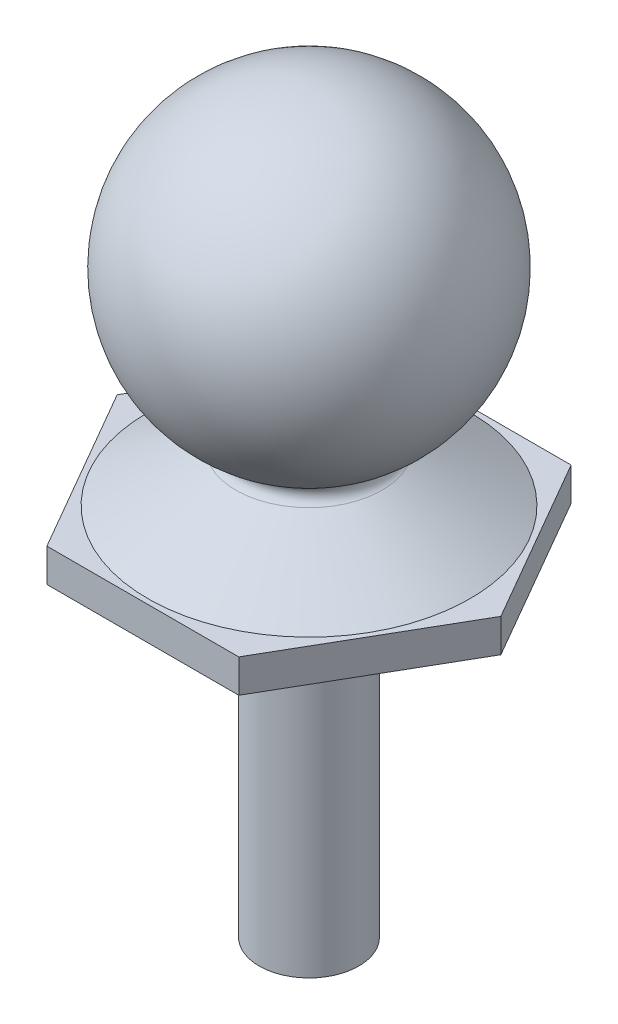
ISO-10303-21;
HEADER;
FILE_DESCRIPTION(('STEP AP214'),'2;1');
FILE_NAME('part.step','',(''),(''),'','','');
FILE_SCHEMA(('AUTOMOTIVE_DESIGN { 1 0 10303 214 1 1 1 1 }'));
ENDSEC;
DATA;
#1=APPLICATION_CONTEXT('core data for automotive mechanical design processes');
#2=APPLICATION_PROTOCOL_DEFINITION('international standard','automotive_design',2000,#1);
#3=PRODUCT_CONTEXT('',#1,'mechanical');
#4=PRODUCT('Part','Part','',(#3));
#5=PRODUCT_RELATED_PRODUCT_CATEGORY('part','',(#4));
#6=PRODUCT_DEFINITION_FORMATION('','',#4);
#7=PRODUCT_DEFINITION_CONTEXT('part definition',#1,'design');
#8=PRODUCT_DEFINITION('design','',#6,#7);
#9=PRODUCT_DEFINITION_SHAPE('','',#8);
#10=(LENGTH_UNIT() NAMED_UNIT(*) SI_UNIT(.MILLI.,.METRE.));
#11=(NAMED_UNIT(*) PLANE_ANGLE_UNIT() SI_UNIT($,.RADIAN.));
#12=(NAMED_UNIT(*) SI_UNIT($,.STERADIAN.) SOLID_ANGLE_UNIT());
#13=UNCERTAINTY_MEASURE_WITH_UNIT(LENGTH_MEASURE(1.E-05),#10,'distance_accuracy_value','');
#14=(GEOMETRIC_REPRESENTATION_CONTEXT(3) GLOBAL_UNCERTAINTY_ASSIGNED_CONTEXT((#13)) GLOBAL_UNIT_ASSIGNED_CONTEXT((#10,
#11,#12)) REPRESENTATION_CONTEXT('',''));
#15=CARTESIAN_POINT('',(0.,0.,0.));
#16=DIRECTION('',(0.,0.,1.));
#17=DIRECTION('',(1.,0.,0.));
#18=AXIS2_PLACEMENT_3D('',#15,#16,#17);
#19=CARTESIAN_POINT('',(0.,-4.43691260265973,0.));
#20=DIRECTION('',(0.,1.,0.));
#21=DIRECTION('',(-1.,0.,0.));
#22=AXIS2_PLACEMENT_3D('',#19,#20,#21);
#23=TOROIDAL_SURFACE('',#22,2.35436537108675,0.313369729864637);
#24=CARTESIAN_POINT('',(0.,-4.1642004470709,0.));
#25=DIRECTION('',(0.,1.,0.));
#26=DIRECTION('',(-1.,0.,0.));
#27=AXIS2_PLACEMENT_3D('',#24,#25,#26);
#28=CIRCLE('',#27,2.20000000000395);
#29=CARTESIAN_POINT('',(-2.20000000000395,-4.1642004470709,0.));
#30=VERTEX_POINT('',#29);
#31=EDGE_CURVE('E130',#30,#30,#28,.T.);
#32=ORIENTED_EDGE('',*,*,#31,.F.);
#33=EDGE_LOOP('',(#32));
#34=FACE_BOUND('',#33,.T.);
#35=CARTESIAN_POINT('',(0.,-4.70962475824633,0.));
#36=DIRECTION('',(0.,1.,0.));
#37=DIRECTION('',(-1.,0.,0.));
#38=AXIS2_PLACEMENT_3D('',#35,#36,#37);
#39=CIRCLE('',#38,2.2);
#40=CARTESIAN_POINT('',(-2.2,-4.70962475824633,0.));
#41=VERTEX_POINT('',#40);
#42=EDGE_CURVE('E11',#41,#41,#39,.T.);
#43=ORIENTED_EDGE('',*,*,#42,.T.);
#44=EDGE_LOOP('',(#43));
#45=FACE_BOUND('',#44,.T.);
#46=ADVANCED_FACE('F33',(#34,#45),#23,.F.);
#47=CARTESIAN_POINT('',(0.,-6.20962475824633,0.));
#48=DIRECTION('',(0.,-1.,0.));
#49=DIRECTION('',(1.,0.,0.));
#50=AXIS2_PLACEMENT_3D('',#47,#48,#49);
#51=CONICAL_SURFACE('',#50,4.85,1.05572350977611);
#52=ORIENTED_EDGE('',*,*,#42,.F.);
#53=EDGE_LOOP('',(#52));
#54=FACE_BOUND('',#53,.T.);
#55=CARTESIAN_POINT('',(0.,-6.20962475824633,0.));
#56=DIRECTION('',(0.,1.,0.));
#57=DIRECTION('',(-1.,0.,0.));
#58=AXIS2_PLACEMENT_3D('',#55,#56,#57);
#59=CIRCLE('',#58,4.85);
#60=CARTESIAN_POINT('',(-4.85,-6.20962475824633,0.));
#61=VERTEX_POINT('',#60);
#62=EDGE_CURVE('E41',#61,#61,#59,.T.);
#63=ORIENTED_EDGE('',*,*,#62,.T.);
#64=EDGE_LOOP('',(#63));
#65=FACE_BOUND('',#64,.T.);
#66=ADVANCED_FACE('F147',(#54,#65),#51,.T.);
#67=CARTESIAN_POINT('',(4.85,-6.20962475824633,0.));
#68=DIRECTION('',(0.,-1.,0.));
#69=DIRECTION('',(1.,0.,0.));
#70=AXIS2_PLACEMENT_3D('',#67,#68,#69);
#71=PLANE('',#70);
#72=ORIENTED_EDGE('',*,*,#62,.F.);
#73=EDGE_LOOP('',(#72));
#74=FACE_BOUND('',#73,.T.);
#75=DIRECTION('',(0.5,0.,-0.866025403784438));
#76=VECTOR('',#75,1.);
#77=CARTESIAN_POINT('',(-5.77350269189626,-6.20962475824633,0.));
#78=LINE('',#77,#76);
#79=CARTESIAN_POINT('',(-5.77350269189626,-6.20962475824633,0.));
#80=VERTEX_POINT('',#79);
#81=CARTESIAN_POINT('',(-2.88675134594813,-6.20962475824633,-5.00000000000001));
#82=VERTEX_POINT('',#81);
#83=EDGE_CURVE('E104',#80,#82,#78,.T.);
#84=ORIENTED_EDGE('',*,*,#83,.F.);
#85=DIRECTION('',(-0.5,0.,-0.866025403784439));
#86=VECTOR('',#85,1.);
#87=CARTESIAN_POINT('',(-2.88675134594813,-6.20962475824633,5.00000000000001));
#88=LINE('',#87,#86);
#89=CARTESIAN_POINT('',(-2.88675134594813,-6.20962475824633,5.00000000000001));
#90=VERTEX_POINT('',#89);
#91=EDGE_CURVE('E94',#90,#80,#88,.T.);
#92=ORIENTED_EDGE('',*,*,#91,.F.);
#93=DIRECTION('',(-1.,0.,0.));
#94=VECTOR('',#93,1.);
#95=CARTESIAN_POINT('',(2.88675134594813,-6.20962475824633,5.00000000000001));
#96=LINE('',#95,#94);
#97=CARTESIAN_POINT('',(2.88675134594813,-6.20962475824633,5.00000000000001));
#98=VERTEX_POINT('',#97);
#99=EDGE_CURVE('E105',#98,#90,#96,.T.);
#100=ORIENTED_EDGE('',*,*,#99,.F.);
#101=DIRECTION('',(-0.5,0.,0.866025403784439));
#102=VECTOR('',#101,1.);
#103=CARTESIAN_POINT('',(5.77350269189626,-6.20962475824633,0.));
#104=LINE('',#103,#102);
#105=CARTESIAN_POINT('',(5.77350269189626,-6.20962475824633,0.));
#106=VERTEX_POINT('',#105);
#107=EDGE_CURVE('E278',#106,#98,#104,.T.);
#108=ORIENTED_EDGE('',*,*,#107,.F.);
#109=DIRECTION('',(0.5,0.,0.866025403784439));
#110=VECTOR('',#109,1.);
#111=CARTESIAN_POINT('',(2.88675134594813,-6.20962475824633,-5.00000000000001));
#112=LINE('',#111,#110);
#113=CARTESIAN_POINT('',(2.88675134594813,-6.20962475824633,-5.00000000000001));
#114=VERTEX_POINT('',#113);
#115=EDGE_CURVE('E82',#114,#106,#112,.T.);
#116=ORIENTED_EDGE('',*,*,#115,.F.);
#117=DIRECTION('',(1.,0.,0.));
#118=VECTOR('',#117,1.);
#119=CARTESIAN_POINT('',(-2.88675134594813,-6.20962475824633,-5.00000000000001));
#120=LINE('',#119,#118);
#121=EDGE_CURVE('E49',#82,#114,#120,.T.);
#122=ORIENTED_EDGE('',*,*,#121,.F.);
#123=EDGE_LOOP('',(#84,#92,#100,#108,#116,#122));
#124=FACE_BOUND('',#123,.T.);
#125=ADVANCED_FACE('F112',(#74,#124),#71,.F.);
#126=CARTESIAN_POINT('',(0.,0.,0.));
#127=DIRECTION('',(0.,1.,0.));
#128=DIRECTION('',(1.,0.,0.));
#129=AXIS2_PLACEMENT_3D('',#126,#127,#128);
#130=SPHERICAL_SURFACE('',#129,4.70962475823742);
#131=ORIENTED_EDGE('',*,*,#31,.T.);
#132=EDGE_LOOP('',(#131));
#133=FACE_BOUND('',#132,.T.);
#134=ADVANCED_FACE('F150',(#133),#130,.T.);
#135=CARTESIAN_POINT('',(2.88675134594813,-6.20962475824633,-5.00000000000001));
#136=DIRECTION('',(0.866025403784439,0.,-0.5));
#137=DIRECTION('',(-0.5,0.,-0.866025403784439));
#138=AXIS2_PLACEMENT_3D('',#135,#136,#137);
#139=PLANE('',#138);
#140=ORIENTED_EDGE('',*,*,#115,.T.);
#141=DIRECTION('',(0.,-1.,0.));
#142=VECTOR('',#141,1.);
#143=CARTESIAN_POINT('',(5.77350269189626,-6.20962475824633,0.));
#144=LINE('',#143,#142);
#145=CARTESIAN_POINT('',(5.77350269189626,-7.20962475824633,0.));
#146=VERTEX_POINT('',#145);
#147=EDGE_CURVE('E114',#106,#146,#144,.T.);
#148=ORIENTED_EDGE('',*,*,#147,.T.);
#149=DIRECTION('',(0.5,0.,0.866025403784439));
#150=VECTOR('',#149,1.);
#151=CARTESIAN_POINT('',(2.88675134594813,-7.20962475824633,-5.00000000000001));
#152=LINE('',#151,#150);
#153=CARTESIAN_POINT('',(2.88675134594813,-7.20962475824633,-5.00000000000001));
#154=VERTEX_POINT('',#153);
#155=EDGE_CURVE('E118',#154,#146,#152,.T.);
#156=ORIENTED_EDGE('',*,*,#155,.F.);
#157=DIRECTION('',(0.,-1.,0.));
#158=VECTOR('',#157,1.);
#159=CARTESIAN_POINT('',(2.88675134594813,-6.20962475824633,-5.00000000000001));
#160=LINE('',#159,#158);
#161=EDGE_CURVE('E128',#114,#154,#160,.T.);
#162=ORIENTED_EDGE('',*,*,#161,.F.);
#163=EDGE_LOOP('',(#140,#148,#156,#162));
#164=FACE_BOUND('',#163,.T.);
#165=ADVANCED_FACE('F156',(#164),#139,.T.);
#166=CARTESIAN_POINT('',(-2.88675134594813,-6.20962475824633,-5.00000000000001));
#167=DIRECTION('',(0.,0.,-1.));
#168=DIRECTION('',(-1.,0.,0.));
#169=AXIS2_PLACEMENT_3D('',#166,#167,#168);
#170=PLANE('',#169);
#171=ORIENTED_EDGE('',*,*,#121,.T.);
#172=ORIENTED_EDGE('',*,*,#161,.T.);
#173=DIRECTION('',(1.,0.,0.));
#174=VECTOR('',#173,1.);
#175=CARTESIAN_POINT('',(-2.88675134594813,-7.20962475824633,-5.00000000000001));
#176=LINE('',#175,#174);
#177=CARTESIAN_POINT('',(-2.88675134594813,-7.20962475824633,-5.00000000000001));
#178=VERTEX_POINT('',#177);
#179=EDGE_CURVE('E75',#178,#154,#176,.T.);
#180=ORIENTED_EDGE('',*,*,#179,.F.);
#181=DIRECTION('',(0.,-1.,0.));
#182=VECTOR('',#181,1.);
#183=CARTESIAN_POINT('',(-2.88675134594813,-6.20962475824633,-5.00000000000001));
#184=LINE('',#183,#182);
#185=EDGE_CURVE('E110',#82,#178,#184,.T.);
#186=ORIENTED_EDGE('',*,*,#185,.F.);
#187=EDGE_LOOP('',(#171,#172,#180,#186));
#188=FACE_BOUND('',#187,.T.);
#189=ADVANCED_FACE('F217',(#188),#170,.T.);
#190=CARTESIAN_POINT('',(-5.77350269189626,-6.20962475824633,0.));
#191=DIRECTION('',(-0.866025403784439,0.,-0.5));
#192=DIRECTION('',(-0.5,0.,0.866025403784439));
#193=AXIS2_PLACEMENT_3D('',#190,#191,#192);
#194=PLANE('',#193);
#195=ORIENTED_EDGE('',*,*,#83,.T.);
#196=ORIENTED_EDGE('',*,*,#185,.T.);
#197=DIRECTION('',(0.5,0.,-0.866025403784438));
#198=VECTOR('',#197,1.);
#199=CARTESIAN_POINT('',(-5.77350269189626,-7.20962475824633,0.));
#200=LINE('',#199,#198);
#201=CARTESIAN_POINT('',(-5.77350269189626,-7.20962475824633,0.));
#202=VERTEX_POINT('',#201);
#203=EDGE_CURVE('E72',#202,#178,#200,.T.);
#204=ORIENTED_EDGE('',*,*,#203,.F.);
#205=DIRECTION('',(0.,-1.,0.));
#206=VECTOR('',#205,1.);
#207=CARTESIAN_POINT('',(-5.77350269189626,-6.20962475824633,0.));
#208=LINE('',#207,#206);
#209=EDGE_CURVE('E98',#80,#202,#208,.T.);
#210=ORIENTED_EDGE('',*,*,#209,.F.);
#211=EDGE_LOOP('',(#195,#196,#204,#210));
#212=FACE_BOUND('',#211,.T.);
#213=ADVANCED_FACE('F108',(#212),#194,.T.);
#214=CARTESIAN_POINT('',(-2.88675134594813,-6.20962475824633,5.00000000000001));
#215=DIRECTION('',(-0.866025403784439,0.,0.5));
#216=DIRECTION('',(0.5,0.,0.866025403784439));
#217=AXIS2_PLACEMENT_3D('',#214,#215,#216);
#218=PLANE('',#217);
#219=ORIENTED_EDGE('',*,*,#91,.T.);
#220=ORIENTED_EDGE('',*,*,#209,.T.);
#221=DIRECTION('',(-0.5,0.,-0.866025403784439));
#222=VECTOR('',#221,1.);
#223=CARTESIAN_POINT('',(-2.88675134594813,-7.20962475824633,5.00000000000001));
#224=LINE('',#223,#222);
#225=CARTESIAN_POINT('',(-2.88675134594813,-7.20962475824633,5.00000000000001));
#226=VERTEX_POINT('',#225);
#227=EDGE_CURVE('E124',#226,#202,#224,.T.);
#228=ORIENTED_EDGE('',*,*,#227,.F.);
#229=DIRECTION('',(0.,-1.,0.));
#230=VECTOR('',#229,1.);
#231=CARTESIAN_POINT('',(-2.88675134594813,-6.20962475824633,5.00000000000001));
#232=LINE('',#231,#230);
#233=EDGE_CURVE('E100',#90,#226,#232,.T.);
#234=ORIENTED_EDGE('',*,*,#233,.F.);
#235=EDGE_LOOP('',(#219,#220,#228,#234));
#236=FACE_BOUND('',#235,.T.);
#237=ADVANCED_FACE('F96',(#236),#218,.T.);
#238=CARTESIAN_POINT('',(2.88675134594813,-6.20962475824633,5.00000000000001));
#239=DIRECTION('',(0.,0.,1.));
#240=DIRECTION('',(1.,0.,0.));
#241=AXIS2_PLACEMENT_3D('',#238,#239,#240);
#242=PLANE('',#241);
#243=ORIENTED_EDGE('',*,*,#99,.T.);
#244=ORIENTED_EDGE('',*,*,#233,.T.);
#245=DIRECTION('',(-1.,0.,0.));
#246=VECTOR('',#245,1.);
#247=CARTESIAN_POINT('',(2.88675134594813,-7.20962475824633,5.00000000000001));
#248=LINE('',#247,#246);
#249=CARTESIAN_POINT('',(2.88675134594813,-7.20962475824633,5.00000000000001));
#250=VERTEX_POINT('',#249);
#251=EDGE_CURVE('E122',#250,#226,#248,.T.);
#252=ORIENTED_EDGE('',*,*,#251,.F.);
#253=DIRECTION('',(0.,-1.,0.));
#254=VECTOR('',#253,1.);
#255=CARTESIAN_POINT('',(2.88675134594813,-6.20962475824633,5.00000000000001));
#256=LINE('',#255,#254);
#257=EDGE_CURVE('E133',#98,#250,#256,.T.);
#258=ORIENTED_EDGE('',*,*,#257,.F.);
#259=EDGE_LOOP('',(#243,#244,#252,#258));
#260=FACE_BOUND('',#259,.T.);
#261=ADVANCED_FACE('F242',(#260),#242,.T.);
#262=CARTESIAN_POINT('',(5.77350269189626,-6.20962475824633,0.));
#263=DIRECTION('',(0.866025403784439,0.,0.5));
#264=DIRECTION('',(0.5,0.,-0.866025403784439));
#265=AXIS2_PLACEMENT_3D('',#262,#263,#264);
#266=PLANE('',#265);
#267=ORIENTED_EDGE('',*,*,#107,.T.);
#268=ORIENTED_EDGE('',*,*,#257,.T.);
#269=DIRECTION('',(-0.5,0.,0.866025403784439));
#270=VECTOR('',#269,1.);
#271=CARTESIAN_POINT('',(5.77350269189626,-7.20962475824633,0.));
#272=LINE('',#271,#270);
#273=EDGE_CURVE('E120',#146,#250,#272,.T.);
#274=ORIENTED_EDGE('',*,*,#273,.F.);
#275=ORIENTED_EDGE('',*,*,#147,.F.);
#276=EDGE_LOOP('',(#267,#268,#274,#275));
#277=FACE_BOUND('',#276,.T.);
#278=ADVANCED_FACE('F196',(#277),#266,.T.);
#279=CARTESIAN_POINT('',(0.,-17.4596247582463,0.));
#280=DIRECTION('',(0.,1.,0.));
#281=DIRECTION('',(-1.,0.,0.));
#282=AXIS2_PLACEMENT_3D('',#279,#280,#281);
#283=PLANE('',#282);
#284=CARTESIAN_POINT('',(0.,-17.4596247582463,0.));
#285=DIRECTION('',(0.,1.,0.));
#286=DIRECTION('',(-1.,0.,0.));
#287=AXIS2_PLACEMENT_3D('',#284,#285,#286);
#288=CIRCLE('',#287,1.5);
#289=CARTESIAN_POINT('',(-1.5,-17.4596247582463,0.));
#290=VERTEX_POINT('',#289);
#291=EDGE_CURVE('E139',#290,#290,#288,.T.);
#292=ORIENTED_EDGE('',*,*,#291,.F.);
#293=EDGE_LOOP('',(#292));
#294=FACE_BOUND('',#293,.T.);
#295=ADVANCED_FACE('F184',(#294),#283,.F.);
#296=CARTESIAN_POINT('',(0.,4.70962475823742,0.));
#297=DIRECTION('',(0.,1.,0.));
#298=DIRECTION('',(-1.,0.,0.));
#299=AXIS2_PLACEMENT_3D('',#296,#297,#298);
#300=CYLINDRICAL_SURFACE('',#299,1.5);
#301=CARTESIAN_POINT('',(0.,-7.20962475824632,0.));
#302=DIRECTION('',(0.,1.,0.));
#303=DIRECTION('',(-1.,0.,0.));
#304=AXIS2_PLACEMENT_3D('',#301,#302,#303);
#305=CIRCLE('',#304,1.5);
#306=CARTESIAN_POINT('',(-1.5,-7.20962475824632,0.));
#307=VERTEX_POINT('',#306);
#308=EDGE_CURVE('E142',#307,#307,#305,.T.);
#309=ORIENTED_EDGE('',*,*,#308,.F.);
#310=EDGE_LOOP('',(#309));
#311=FACE_BOUND('',#310,.T.);
#312=ORIENTED_EDGE('',*,*,#291,.T.);
#313=EDGE_LOOP('',(#312));
#314=FACE_BOUND('',#313,.T.);
#315=ADVANCED_FACE('F178',(#311,#314),#300,.T.);
#316=CARTESIAN_POINT('',(1.5,-7.20962475824633,0.));
#317=DIRECTION('',(0.,1.,0.));
#318=DIRECTION('',(-1.,0.,0.));
#319=AXIS2_PLACEMENT_3D('',#316,#317,#318);
#320=PLANE('',#319);
#321=ORIENTED_EDGE('',*,*,#203,.T.);
#322=ORIENTED_EDGE('',*,*,#179,.T.);
#323=ORIENTED_EDGE('',*,*,#155,.T.);
#324=ORIENTED_EDGE('',*,*,#273,.T.);
#325=ORIENTED_EDGE('',*,*,#251,.T.);
#326=ORIENTED_EDGE('',*,*,#227,.T.);
#327=EDGE_LOOP('',(#321,#322,#323,#324,#325,#326));
#328=FACE_BOUND('',#327,.T.);
#329=ORIENTED_EDGE('',*,*,#308,.T.);
#330=EDGE_LOOP('',(#329));
#331=FACE_BOUND('',#330,.T.);
#332=ADVANCED_FACE('F183',(#328,#331),#320,.F.);
#333=CLOSED_SHELL('',(#46,#66,#125,#134,#165,#189,#213,#237,#261,#278,#295,#315,#332));
#334=MANIFOLD_SOLID_BREP('B2',#333);
#335=ADVANCED_BREP_SHAPE_REPRESENTATION('',(#18,#334),#14);
#336=SHAPE_DEFINITION_REPRESENTATION(#9,#335);
ENDSEC;
END-ISO-10303-21;
